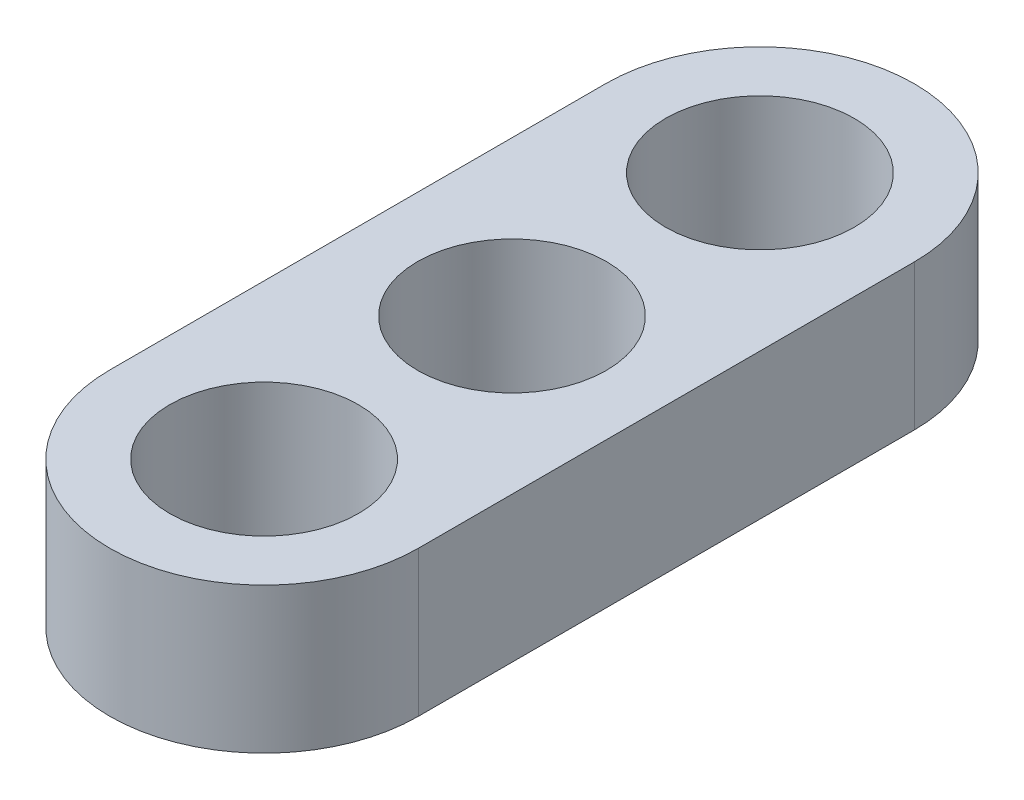
ISO-10303-21;
HEADER;
FILE_DESCRIPTION(('STEP AP214'),'2;1');
FILE_NAME('part.step','',(''),(''),'','','');
FILE_SCHEMA(('AUTOMOTIVE_DESIGN { 1 0 10303 214 1 1 1 1 }'));
ENDSEC;
DATA;
#1=APPLICATION_CONTEXT('core data for automotive mechanical design processes');
#2=APPLICATION_PROTOCOL_DEFINITION('international standard','automotive_design',2000,#1);
#3=PRODUCT_CONTEXT('',#1,'mechanical');
#4=PRODUCT('Part','Part','',(#3));
#5=PRODUCT_RELATED_PRODUCT_CATEGORY('part','',(#4));
#6=PRODUCT_DEFINITION_FORMATION('','',#4);
#7=PRODUCT_DEFINITION_CONTEXT('part definition',#1,'design');
#8=PRODUCT_DEFINITION('design','',#6,#7);
#9=PRODUCT_DEFINITION_SHAPE('','',#8);
#10=(LENGTH_UNIT() NAMED_UNIT(*) SI_UNIT(.MILLI.,.METRE.));
#11=(NAMED_UNIT(*) PLANE_ANGLE_UNIT() SI_UNIT($,.RADIAN.));
#12=(NAMED_UNIT(*) SI_UNIT($,.STERADIAN.) SOLID_ANGLE_UNIT());
#13=UNCERTAINTY_MEASURE_WITH_UNIT(LENGTH_MEASURE(1.E-05),#10,'distance_accuracy_value','');
#14=(GEOMETRIC_REPRESENTATION_CONTEXT(3) GLOBAL_UNCERTAINTY_ASSIGNED_CONTEXT((#13)) GLOBAL_UNIT_ASSIGNED_CONTEXT((#10,
#11,#12)) REPRESENTATION_CONTEXT('',''));
#15=CARTESIAN_POINT('',(0.,0.,0.));
#16=DIRECTION('',(0.,0.,1.));
#17=DIRECTION('',(1.,0.,0.));
#18=AXIS2_PLACEMENT_3D('',#15,#16,#17);
#19=CARTESIAN_POINT('',(0.,2.3114,3.937));
#20=DIRECTION('',(0.,1.,0.));
#21=DIRECTION('',(0.,0.,1.));
#22=AXIS2_PLACEMENT_3D('',#19,#20,#21);
#23=PLANE('',#22);
#24=CARTESIAN_POINT('',(0.,2.3114,3.937));
#25=DIRECTION('',(0.,1.,0.));
#26=DIRECTION('',(0.,0.,1.));
#27=AXIS2_PLACEMENT_3D('',#24,#25,#26);
#28=CIRCLE('',#27,1.4986);
#29=CARTESIAN_POINT('',(0.,2.3114,5.4356));
#30=VERTEX_POINT('',#29);
#31=EDGE_CURVE('E119',#30,#30,#28,.T.);
#32=ORIENTED_EDGE('',*,*,#31,.F.);
#33=EDGE_LOOP('',(#32));
#34=FACE_BOUND('',#33,.T.);
#35=CARTESIAN_POINT('',(0.,2.3114,3.937));
#36=DIRECTION('',(0.,1.,0.));
#37=DIRECTION('',(0.,0.,1.));
#38=AXIS2_PLACEMENT_3D('',#35,#36,#37);
#39=CIRCLE('',#38,2.4511);
#40=CARTESIAN_POINT('',(-2.4511,2.3114,3.937));
#41=VERTEX_POINT('',#40);
#42=CARTESIAN_POINT('',(2.4511,2.3114,3.937));
#43=VERTEX_POINT('',#42);
#44=EDGE_CURVE('E89',#41,#43,#39,.T.);
#45=ORIENTED_EDGE('',*,*,#44,.T.);
#46=DIRECTION('',(0.,0.,-1.));
#47=VECTOR('',#46,1.);
#48=CARTESIAN_POINT('',(2.4511,2.3114,3.937));
#49=LINE('',#48,#47);
#50=CARTESIAN_POINT('',(2.4511,2.3114,-3.937));
#51=VERTEX_POINT('',#50);
#52=EDGE_CURVE('E84',#43,#51,#49,.T.);
#53=ORIENTED_EDGE('',*,*,#52,.T.);
#54=CARTESIAN_POINT('',(0.,2.3114,-3.937));
#55=DIRECTION('',(0.,1.,0.));
#56=DIRECTION('',(0.,0.,1.));
#57=AXIS2_PLACEMENT_3D('',#54,#55,#56);
#58=CIRCLE('',#57,2.4511);
#59=CARTESIAN_POINT('',(-2.4511,2.3114,-3.937));
#60=VERTEX_POINT('',#59);
#61=EDGE_CURVE('E87',#51,#60,#58,.T.);
#62=ORIENTED_EDGE('',*,*,#61,.T.);
#63=DIRECTION('',(0.,0.,1.));
#64=VECTOR('',#63,1.);
#65=CARTESIAN_POINT('',(-2.4511,2.3114,3.937));
#66=LINE('',#65,#64);
#67=EDGE_CURVE('E54',#60,#41,#66,.T.);
#68=ORIENTED_EDGE('',*,*,#67,.T.);
#69=EDGE_LOOP('',(#45,#53,#62,#68));
#70=FACE_BOUND('',#69,.T.);
#71=CARTESIAN_POINT('',(0.,2.3114,-3.937));
#72=DIRECTION('',(0.,1.,0.));
#73=DIRECTION('',(0.,0.,1.));
#74=AXIS2_PLACEMENT_3D('',#71,#72,#73);
#75=CIRCLE('',#74,1.4986);
#76=CARTESIAN_POINT('',(0.,2.3114,-2.4384));
#77=VERTEX_POINT('',#76);
#78=EDGE_CURVE('E104',#77,#77,#75,.T.);
#79=ORIENTED_EDGE('',*,*,#78,.F.);
#80=EDGE_LOOP('',(#79));
#81=FACE_BOUND('',#80,.T.);
#82=CARTESIAN_POINT('',(0.,2.3114,0.));
#83=DIRECTION('',(0.,1.,0.));
#84=DIRECTION('',(0.,0.,1.));
#85=AXIS2_PLACEMENT_3D('',#82,#83,#84);
#86=CIRCLE('',#85,1.4986);
#87=CARTESIAN_POINT('',(0.,2.3114,1.4986));
#88=VERTEX_POINT('',#87);
#89=EDGE_CURVE('E125',#88,#88,#86,.T.);
#90=ORIENTED_EDGE('',*,*,#89,.F.);
#91=EDGE_LOOP('',(#90));
#92=FACE_BOUND('',#91,.T.);
#93=ADVANCED_FACE('F37',(#34,#70,#81,#92),#23,.T.);
#94=CARTESIAN_POINT('',(0.,0.,3.937));
#95=DIRECTION('',(0.,1.,0.));
#96=DIRECTION('',(0.,0.,1.));
#97=AXIS2_PLACEMENT_3D('',#94,#95,#96);
#98=PLANE('',#97);
#99=CARTESIAN_POINT('',(0.,0.,3.937));
#100=DIRECTION('',(0.,1.,0.));
#101=DIRECTION('',(0.,0.,1.));
#102=AXIS2_PLACEMENT_3D('',#99,#100,#101);
#103=CIRCLE('',#102,2.4511);
#104=CARTESIAN_POINT('',(-2.4511,0.,3.937));
#105=VERTEX_POINT('',#104);
#106=CARTESIAN_POINT('',(2.4511,0.,3.937));
#107=VERTEX_POINT('',#106);
#108=EDGE_CURVE('E101',#105,#107,#103,.T.);
#109=ORIENTED_EDGE('',*,*,#108,.F.);
#110=DIRECTION('',(0.,0.,1.));
#111=VECTOR('',#110,1.);
#112=CARTESIAN_POINT('',(-2.4511,0.,3.937));
#113=LINE('',#112,#111);
#114=CARTESIAN_POINT('',(-2.4511,0.,-3.937));
#115=VERTEX_POINT('',#114);
#116=EDGE_CURVE('E77',#115,#105,#113,.T.);
#117=ORIENTED_EDGE('',*,*,#116,.F.);
#118=CARTESIAN_POINT('',(0.,0.,-3.937));
#119=DIRECTION('',(0.,1.,0.));
#120=DIRECTION('',(0.,0.,1.));
#121=AXIS2_PLACEMENT_3D('',#118,#119,#120);
#122=CIRCLE('',#121,2.4511);
#123=CARTESIAN_POINT('',(2.4511,0.,-3.937));
#124=VERTEX_POINT('',#123);
#125=EDGE_CURVE('E71',#124,#115,#122,.T.);
#126=ORIENTED_EDGE('',*,*,#125,.F.);
#127=DIRECTION('',(0.,0.,-1.));
#128=VECTOR('',#127,1.);
#129=CARTESIAN_POINT('',(2.4511,0.,3.937));
#130=LINE('',#129,#128);
#131=EDGE_CURVE('E93',#107,#124,#130,.T.);
#132=ORIENTED_EDGE('',*,*,#131,.F.);
#133=EDGE_LOOP('',(#109,#117,#126,#132));
#134=FACE_BOUND('',#133,.T.);
#135=CARTESIAN_POINT('',(0.,0.,-3.937));
#136=DIRECTION('',(0.,1.,0.));
#137=DIRECTION('',(0.,0.,1.));
#138=AXIS2_PLACEMENT_3D('',#135,#136,#137);
#139=CIRCLE('',#138,1.4986);
#140=CARTESIAN_POINT('',(0.,0.,-2.4384));
#141=VERTEX_POINT('',#140);
#142=EDGE_CURVE('E116',#141,#141,#139,.T.);
#143=ORIENTED_EDGE('',*,*,#142,.T.);
#144=EDGE_LOOP('',(#143));
#145=FACE_BOUND('',#144,.T.);
#146=CARTESIAN_POINT('',(0.,0.,3.937));
#147=DIRECTION('',(0.,1.,0.));
#148=DIRECTION('',(0.,0.,1.));
#149=AXIS2_PLACEMENT_3D('',#146,#147,#148);
#150=CIRCLE('',#149,1.4986);
#151=CARTESIAN_POINT('',(0.,0.,5.4356));
#152=VERTEX_POINT('',#151);
#153=EDGE_CURVE('E122',#152,#152,#150,.T.);
#154=ORIENTED_EDGE('',*,*,#153,.T.);
#155=EDGE_LOOP('',(#154));
#156=FACE_BOUND('',#155,.T.);
#157=CARTESIAN_POINT('',(0.,0.,0.));
#158=DIRECTION('',(0.,1.,0.));
#159=DIRECTION('',(0.,0.,1.));
#160=AXIS2_PLACEMENT_3D('',#157,#158,#159);
#161=CIRCLE('',#160,1.4986);
#162=CARTESIAN_POINT('',(0.,0.,1.4986));
#163=VERTEX_POINT('',#162);
#164=EDGE_CURVE('E128',#163,#163,#161,.T.);
#165=ORIENTED_EDGE('',*,*,#164,.T.);
#166=EDGE_LOOP('',(#165));
#167=FACE_BOUND('',#166,.T.);
#168=ADVANCED_FACE('F112',(#134,#145,#156,#167),#98,.F.);
#169=CARTESIAN_POINT('',(0.,2.3114,3.937));
#170=DIRECTION('',(0.,-1.,0.));
#171=DIRECTION('',(0.,0.,-1.));
#172=AXIS2_PLACEMENT_3D('',#169,#170,#171);
#173=CYLINDRICAL_SURFACE('',#172,2.4511);
#174=ORIENTED_EDGE('',*,*,#108,.T.);
#175=DIRECTION('',(0.,-1.,0.));
#176=VECTOR('',#175,1.);
#177=CARTESIAN_POINT('',(2.4511,2.3114,3.937));
#178=LINE('',#177,#176);
#179=EDGE_CURVE('E11',#43,#107,#178,.T.);
#180=ORIENTED_EDGE('',*,*,#179,.F.);
#181=ORIENTED_EDGE('',*,*,#44,.F.);
#182=DIRECTION('',(0.,-1.,0.));
#183=VECTOR('',#182,1.);
#184=CARTESIAN_POINT('',(-2.4511,2.3114,3.937));
#185=LINE('',#184,#183);
#186=EDGE_CURVE('E97',#41,#105,#185,.T.);
#187=ORIENTED_EDGE('',*,*,#186,.T.);
#188=EDGE_LOOP('',(#174,#180,#181,#187));
#189=FACE_BOUND('',#188,.T.);
#190=ADVANCED_FACE('F39',(#189),#173,.T.);
#191=CARTESIAN_POINT('',(2.4511,2.3114,3.937));
#192=DIRECTION('',(-1.,0.,0.));
#193=DIRECTION('',(0.,0.,1.));
#194=AXIS2_PLACEMENT_3D('',#191,#192,#193);
#195=PLANE('',#194);
#196=ORIENTED_EDGE('',*,*,#131,.T.);
#197=DIRECTION('',(0.,-1.,0.));
#198=VECTOR('',#197,1.);
#199=CARTESIAN_POINT('',(2.4511,2.3114,-3.937));
#200=LINE('',#199,#198);
#201=EDGE_CURVE('E46',#51,#124,#200,.T.);
#202=ORIENTED_EDGE('',*,*,#201,.F.);
#203=ORIENTED_EDGE('',*,*,#52,.F.);
#204=ORIENTED_EDGE('',*,*,#179,.T.);
#205=EDGE_LOOP('',(#196,#202,#203,#204));
#206=FACE_BOUND('',#205,.T.);
#207=ADVANCED_FACE('F92',(#206),#195,.F.);
#208=CARTESIAN_POINT('',(0.,2.3114,-3.937));
#209=DIRECTION('',(0.,-1.,0.));
#210=DIRECTION('',(0.,0.,-1.));
#211=AXIS2_PLACEMENT_3D('',#208,#209,#210);
#212=CYLINDRICAL_SURFACE('',#211,2.4511);
#213=ORIENTED_EDGE('',*,*,#125,.T.);
#214=DIRECTION('',(0.,-1.,0.));
#215=VECTOR('',#214,1.);
#216=CARTESIAN_POINT('',(-2.4511,2.3114,-3.937));
#217=LINE('',#216,#215);
#218=EDGE_CURVE('E94',#60,#115,#217,.T.);
#219=ORIENTED_EDGE('',*,*,#218,.F.);
#220=ORIENTED_EDGE('',*,*,#61,.F.);
#221=ORIENTED_EDGE('',*,*,#201,.T.);
#222=EDGE_LOOP('',(#213,#219,#220,#221));
#223=FACE_BOUND('',#222,.T.);
#224=ADVANCED_FACE('F95',(#223),#212,.T.);
#225=CARTESIAN_POINT('',(-2.4511,2.3114,3.937));
#226=DIRECTION('',(1.,0.,0.));
#227=DIRECTION('',(0.,0.,-1.));
#228=AXIS2_PLACEMENT_3D('',#225,#226,#227);
#229=PLANE('',#228);
#230=ORIENTED_EDGE('',*,*,#116,.T.);
#231=ORIENTED_EDGE('',*,*,#186,.F.);
#232=ORIENTED_EDGE('',*,*,#67,.F.);
#233=ORIENTED_EDGE('',*,*,#218,.T.);
#234=EDGE_LOOP('',(#230,#231,#232,#233));
#235=FACE_BOUND('',#234,.T.);
#236=ADVANCED_FACE('F109',(#235),#229,.F.);
#237=CARTESIAN_POINT('',(0.,2.3114,-3.937));
#238=DIRECTION('',(0.,-1.,0.));
#239=DIRECTION('',(0.,0.,-1.));
#240=AXIS2_PLACEMENT_3D('',#237,#238,#239);
#241=CYLINDRICAL_SURFACE('',#240,1.4986);
#242=ORIENTED_EDGE('',*,*,#78,.T.);
#243=EDGE_LOOP('',(#242));
#244=FACE_BOUND('',#243,.T.);
#245=ORIENTED_EDGE('',*,*,#142,.F.);
#246=EDGE_LOOP('',(#245));
#247=FACE_BOUND('',#246,.T.);
#248=ADVANCED_FACE('F146',(#244,#247),#241,.F.);
#249=CARTESIAN_POINT('',(0.,2.3114,3.937));
#250=DIRECTION('',(0.,-1.,0.));
#251=DIRECTION('',(0.,0.,-1.));
#252=AXIS2_PLACEMENT_3D('',#249,#250,#251);
#253=CYLINDRICAL_SURFACE('',#252,1.4986);
#254=ORIENTED_EDGE('',*,*,#31,.T.);
#255=EDGE_LOOP('',(#254));
#256=FACE_BOUND('',#255,.T.);
#257=ORIENTED_EDGE('',*,*,#153,.F.);
#258=EDGE_LOOP('',(#257));
#259=FACE_BOUND('',#258,.T.);
#260=ADVANCED_FACE('F200',(#256,#259),#253,.F.);
#261=CARTESIAN_POINT('',(0.,2.3114,0.));
#262=DIRECTION('',(0.,-1.,0.));
#263=DIRECTION('',(0.,0.,-1.));
#264=AXIS2_PLACEMENT_3D('',#261,#262,#263);
#265=CYLINDRICAL_SURFACE('',#264,1.4986);
#266=ORIENTED_EDGE('',*,*,#89,.T.);
#267=EDGE_LOOP('',(#266));
#268=FACE_BOUND('',#267,.T.);
#269=ORIENTED_EDGE('',*,*,#164,.F.);
#270=EDGE_LOOP('',(#269));
#271=FACE_BOUND('',#270,.T.);
#272=ADVANCED_FACE('F134',(#268,#271),#265,.F.);
#273=CLOSED_SHELL('',(#93,#168,#190,#207,#224,#236,#248,#260,#272));
#274=MANIFOLD_SOLID_BREP('B2',#273);
#275=ADVANCED_BREP_SHAPE_REPRESENTATION('',(#18,#274),#14);
#276=SHAPE_DEFINITION_REPRESENTATION(#9,#275);
ENDSEC;
END-ISO-10303-21;
